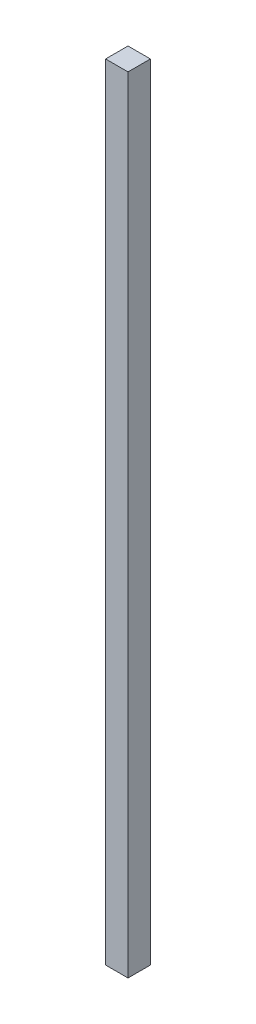
ISO-10303-21;
HEADER;
FILE_DESCRIPTION(('STEP AP214'),'2;1');
FILE_NAME('part.step','',(''),(''),'','','');
FILE_SCHEMA(('AUTOMOTIVE_DESIGN { 1 0 10303 214 1 1 1 1 }'));
ENDSEC;
DATA;
#1=APPLICATION_CONTEXT('core data for automotive mechanical design processes');
#2=APPLICATION_PROTOCOL_DEFINITION('international standard','automotive_design',2000,#1);
#3=PRODUCT_CONTEXT('',#1,'mechanical');
#4=PRODUCT('Part','Part','',(#3));
#5=PRODUCT_RELATED_PRODUCT_CATEGORY('part','',(#4));
#6=PRODUCT_DEFINITION_FORMATION('','',#4);
#7=PRODUCT_DEFINITION_CONTEXT('part definition',#1,'design');
#8=PRODUCT_DEFINITION('design','',#6,#7);
#9=PRODUCT_DEFINITION_SHAPE('','',#8);
#10=(LENGTH_UNIT() NAMED_UNIT(*) SI_UNIT(.MILLI.,.METRE.));
#11=(NAMED_UNIT(*) PLANE_ANGLE_UNIT() SI_UNIT($,.RADIAN.));
#12=(NAMED_UNIT(*) SI_UNIT($,.STERADIAN.) SOLID_ANGLE_UNIT());
#13=UNCERTAINTY_MEASURE_WITH_UNIT(LENGTH_MEASURE(1.E-05),#10,'distance_accuracy_value','');
#14=(GEOMETRIC_REPRESENTATION_CONTEXT(3) GLOBAL_UNCERTAINTY_ASSIGNED_CONTEXT((#13)) GLOBAL_UNIT_ASSIGNED_CONTEXT((#10,
#11,#12)) REPRESENTATION_CONTEXT('',''));
#15=CARTESIAN_POINT('',(0.,0.,0.));
#16=DIRECTION('',(0.,0.,1.));
#17=DIRECTION('',(1.,0.,0.));
#18=AXIS2_PLACEMENT_3D('',#15,#16,#17);
#19=CARTESIAN_POINT('',(5.,350.,-5.));
#20=DIRECTION('',(-1.,0.,0.));
#21=DIRECTION('',(0.,0.,1.));
#22=AXIS2_PLACEMENT_3D('',#19,#20,#21);
#23=PLANE('',#22);
#24=DIRECTION('',(0.,0.,-1.));
#25=VECTOR('',#24,1.);
#26=CARTESIAN_POINT('',(5.,0.,-5.));
#27=LINE('',#26,#25);
#28=CARTESIAN_POINT('',(5.,0.,5.));
#29=VERTEX_POINT('',#28);
#30=CARTESIAN_POINT('',(5.,0.,-5.));
#31=VERTEX_POINT('',#30);
#32=EDGE_CURVE('E97',#29,#31,#27,.T.);
#33=ORIENTED_EDGE('',*,*,#32,.T.);
#34=DIRECTION('',(0.,-1.,0.));
#35=VECTOR('',#34,1.);
#36=CARTESIAN_POINT('',(5.,350.,-5.));
#37=LINE('',#36,#35);
#38=CARTESIAN_POINT('',(5.,350.,-5.));
#39=VERTEX_POINT('',#38);
#40=EDGE_CURVE('E11',#39,#31,#37,.T.);
#41=ORIENTED_EDGE('',*,*,#40,.F.);
#42=DIRECTION('',(0.,0.,-1.));
#43=VECTOR('',#42,1.);
#44=CARTESIAN_POINT('',(5.,350.,-5.));
#45=LINE('',#44,#43);
#46=CARTESIAN_POINT('',(5.,350.,5.));
#47=VERTEX_POINT('',#46);
#48=EDGE_CURVE('E85',#47,#39,#45,.T.);
#49=ORIENTED_EDGE('',*,*,#48,.F.);
#50=DIRECTION('',(0.,-1.,0.));
#51=VECTOR('',#50,1.);
#52=CARTESIAN_POINT('',(5.,350.,5.));
#53=LINE('',#52,#51);
#54=EDGE_CURVE('E93',#47,#29,#53,.T.);
#55=ORIENTED_EDGE('',*,*,#54,.T.);
#56=EDGE_LOOP('',(#33,#41,#49,#55));
#57=FACE_BOUND('',#56,.T.);
#58=ADVANCED_FACE('F34',(#57),#23,.F.);
#59=CARTESIAN_POINT('',(-5.,350.,-5.));
#60=DIRECTION('',(0.,0.,1.));
#61=DIRECTION('',(1.,0.,0.));
#62=AXIS2_PLACEMENT_3D('',#59,#60,#61);
#63=PLANE('',#62);
#64=DIRECTION('',(-1.,0.,0.));
#65=VECTOR('',#64,1.);
#66=CARTESIAN_POINT('',(-5.,0.,-5.));
#67=LINE('',#66,#65);
#68=CARTESIAN_POINT('',(-5.,0.,-5.));
#69=VERTEX_POINT('',#68);
#70=EDGE_CURVE('E89',#31,#69,#67,.T.);
#71=ORIENTED_EDGE('',*,*,#70,.T.);
#72=DIRECTION('',(0.,-1.,0.));
#73=VECTOR('',#72,1.);
#74=CARTESIAN_POINT('',(-5.,350.,-5.));
#75=LINE('',#74,#73);
#76=CARTESIAN_POINT('',(-5.,350.,-5.));
#77=VERTEX_POINT('',#76);
#78=EDGE_CURVE('E42',#77,#69,#75,.T.);
#79=ORIENTED_EDGE('',*,*,#78,.F.);
#80=DIRECTION('',(-1.,0.,0.));
#81=VECTOR('',#80,1.);
#82=CARTESIAN_POINT('',(-5.,350.,-5.));
#83=LINE('',#82,#81);
#84=EDGE_CURVE('E80',#39,#77,#83,.T.);
#85=ORIENTED_EDGE('',*,*,#84,.F.);
#86=ORIENTED_EDGE('',*,*,#40,.T.);
#87=EDGE_LOOP('',(#71,#79,#85,#86));
#88=FACE_BOUND('',#87,.T.);
#89=ADVANCED_FACE('F88',(#88),#63,.F.);
#90=CARTESIAN_POINT('',(-5.,350.,-5.));
#91=DIRECTION('',(1.,0.,0.));
#92=DIRECTION('',(0.,0.,-1.));
#93=AXIS2_PLACEMENT_3D('',#90,#91,#92);
#94=PLANE('',#93);
#95=DIRECTION('',(0.,0.,1.));
#96=VECTOR('',#95,1.);
#97=CARTESIAN_POINT('',(-5.,0.,-5.));
#98=LINE('',#97,#96);
#99=CARTESIAN_POINT('',(-5.,0.,5.));
#100=VERTEX_POINT('',#99);
#101=EDGE_CURVE('E67',#69,#100,#98,.T.);
#102=ORIENTED_EDGE('',*,*,#101,.T.);
#103=DIRECTION('',(0.,-1.,0.));
#104=VECTOR('',#103,1.);
#105=CARTESIAN_POINT('',(-5.,350.,5.));
#106=LINE('',#105,#104);
#107=CARTESIAN_POINT('',(-5.,350.,5.));
#108=VERTEX_POINT('',#107);
#109=EDGE_CURVE('E90',#108,#100,#106,.T.);
#110=ORIENTED_EDGE('',*,*,#109,.F.);
#111=DIRECTION('',(0.,0.,1.));
#112=VECTOR('',#111,1.);
#113=CARTESIAN_POINT('',(-5.,350.,-5.));
#114=LINE('',#113,#112);
#115=EDGE_CURVE('E83',#77,#108,#114,.T.);
#116=ORIENTED_EDGE('',*,*,#115,.F.);
#117=ORIENTED_EDGE('',*,*,#78,.T.);
#118=EDGE_LOOP('',(#102,#110,#116,#117));
#119=FACE_BOUND('',#118,.T.);
#120=ADVANCED_FACE('F91',(#119),#94,.F.);
#121=CARTESIAN_POINT('',(-5.,350.,5.));
#122=DIRECTION('',(0.,0.,-1.));
#123=DIRECTION('',(-1.,0.,0.));
#124=AXIS2_PLACEMENT_3D('',#121,#122,#123);
#125=PLANE('',#124);
#126=DIRECTION('',(1.,0.,0.));
#127=VECTOR('',#126,1.);
#128=CARTESIAN_POINT('',(-5.,0.,5.));
#129=LINE('',#128,#127);
#130=EDGE_CURVE('E73',#100,#29,#129,.T.);
#131=ORIENTED_EDGE('',*,*,#130,.T.);
#132=ORIENTED_EDGE('',*,*,#54,.F.);
#133=DIRECTION('',(1.,0.,0.));
#134=VECTOR('',#133,1.);
#135=CARTESIAN_POINT('',(-5.,350.,5.));
#136=LINE('',#135,#134);
#137=EDGE_CURVE('E50',#108,#47,#136,.T.);
#138=ORIENTED_EDGE('',*,*,#137,.F.);
#139=ORIENTED_EDGE('',*,*,#109,.T.);
#140=EDGE_LOOP('',(#131,#132,#138,#139));
#141=FACE_BOUND('',#140,.T.);
#142=ADVANCED_FACE('F104',(#141),#125,.F.);
#143=CARTESIAN_POINT('',(0.,350.,0.));
#144=DIRECTION('',(0.,1.,0.));
#145=DIRECTION('',(0.,0.,1.));
#146=AXIS2_PLACEMENT_3D('',#143,#144,#145);
#147=PLANE('',#146);
#148=ORIENTED_EDGE('',*,*,#48,.T.);
#149=ORIENTED_EDGE('',*,*,#84,.T.);
#150=ORIENTED_EDGE('',*,*,#115,.T.);
#151=ORIENTED_EDGE('',*,*,#137,.T.);
#152=EDGE_LOOP('',(#148,#149,#150,#151));
#153=FACE_BOUND('',#152,.T.);
#154=ADVANCED_FACE('F81',(#153),#147,.T.);
#155=CARTESIAN_POINT('',(0.,0.,0.));
#156=DIRECTION('',(0.,1.,0.));
#157=DIRECTION('',(0.,0.,1.));
#158=AXIS2_PLACEMENT_3D('',#155,#156,#157);
#159=PLANE('',#158);
#160=ORIENTED_EDGE('',*,*,#32,.F.);
#161=ORIENTED_EDGE('',*,*,#130,.F.);
#162=ORIENTED_EDGE('',*,*,#101,.F.);
#163=ORIENTED_EDGE('',*,*,#70,.F.);
#164=EDGE_LOOP('',(#160,#161,#162,#163));
#165=FACE_BOUND('',#164,.T.);
#166=ADVANCED_FACE('F107',(#165),#159,.F.);
#167=CLOSED_SHELL('',(#58,#89,#120,#142,#154,#166));
#168=MANIFOLD_SOLID_BREP('B2',#167);
#169=ADVANCED_BREP_SHAPE_REPRESENTATION('',(#18,#168),#14);
#170=SHAPE_DEFINITION_REPRESENTATION(#9,#169);
ENDSEC;
END-ISO-10303-21;
